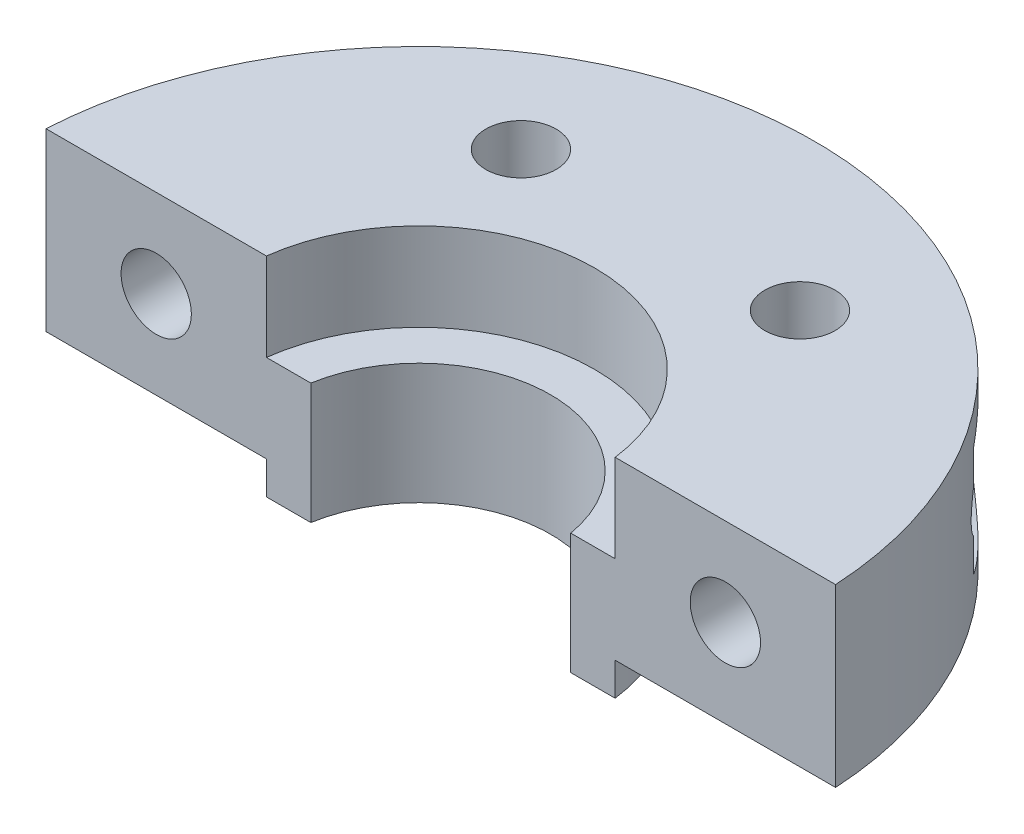
ISO-10303-21;
HEADER;
FILE_DESCRIPTION(('STEP AP214'),'2;1');
FILE_NAME('part.step','',(''),(''),'','','');
FILE_SCHEMA(('AUTOMOTIVE_DESIGN { 1 0 10303 214 1 1 1 1 }'));
ENDSEC;
DATA;
#1=APPLICATION_CONTEXT('core data for automotive mechanical design processes');
#2=APPLICATION_PROTOCOL_DEFINITION('international standard','automotive_design',2000,#1);
#3=PRODUCT_CONTEXT('',#1,'mechanical');
#4=PRODUCT('Part','Part','',(#3));
#5=PRODUCT_RELATED_PRODUCT_CATEGORY('part','',(#4));
#6=PRODUCT_DEFINITION_FORMATION('','',#4);
#7=PRODUCT_DEFINITION_CONTEXT('part definition',#1,'design');
#8=PRODUCT_DEFINITION('design','',#6,#7);
#9=PRODUCT_DEFINITION_SHAPE('','',#8);
#10=(LENGTH_UNIT() NAMED_UNIT(*) SI_UNIT(.MILLI.,.METRE.));
#11=(NAMED_UNIT(*) PLANE_ANGLE_UNIT() SI_UNIT($,.RADIAN.));
#12=(NAMED_UNIT(*) SI_UNIT($,.STERADIAN.) SOLID_ANGLE_UNIT());
#13=UNCERTAINTY_MEASURE_WITH_UNIT(LENGTH_MEASURE(1.E-05),#10,'distance_accuracy_value','');
#14=(GEOMETRIC_REPRESENTATION_CONTEXT(3) GLOBAL_UNCERTAINTY_ASSIGNED_CONTEXT((#13)) GLOBAL_UNIT_ASSIGNED_CONTEXT((#10,
#11,#12)) REPRESENTATION_CONTEXT('',''));
#15=CARTESIAN_POINT('',(0.,0.,0.));
#16=DIRECTION('',(0.,0.,1.));
#17=DIRECTION('',(1.,0.,0.));
#18=AXIS2_PLACEMENT_3D('',#15,#16,#17);
#19=CARTESIAN_POINT('',(0.,8.,0.));
#20=DIRECTION('',(0.,1.,0.));
#21=DIRECTION('',(0.,0.,1.));
#22=AXIS2_PLACEMENT_3D('',#19,#20,#21);
#23=PLANE('',#22);
#24=DIRECTION('',(-1.,0.,0.));
#25=VECTOR('',#24,1.);
#26=CARTESIAN_POINT('',(-20.,8.,-1.));
#27=LINE('',#26,#25);
#28=CARTESIAN_POINT('',(17.9722007556114,8.,-1.));
#29=VERTEX_POINT('',#28);
#30=CARTESIAN_POINT('',(7.93725393319377,8.,-1.));
#31=VERTEX_POINT('',#30);
#32=EDGE_CURVE('E246',#29,#31,#27,.T.);
#33=ORIENTED_EDGE('',*,*,#32,.F.);
#34=CARTESIAN_POINT('',(0.,8.,0.));
#35=DIRECTION('',(0.,1.,0.));
#36=DIRECTION('',(0.,0.,1.));
#37=AXIS2_PLACEMENT_3D('',#34,#35,#36);
#38=CIRCLE('',#37,18.);
#39=CARTESIAN_POINT('',(-17.9722007556114,8.,-1.));
#40=VERTEX_POINT('',#39);
#41=EDGE_CURVE('E297',#29,#40,#38,.T.);
#42=ORIENTED_EDGE('',*,*,#41,.T.);
#43=CARTESIAN_POINT('',(-7.93725393319377,8.,-1.));
#44=VERTEX_POINT('',#43);
#45=EDGE_CURVE('E241',#44,#40,#27,.T.);
#46=ORIENTED_EDGE('',*,*,#45,.F.);
#47=CARTESIAN_POINT('',(0.,8.,0.));
#48=DIRECTION('',(0.,1.,0.));
#49=DIRECTION('',(0.,0.,1.));
#50=AXIS2_PLACEMENT_3D('',#47,#48,#49);
#51=CIRCLE('',#50,8.);
#52=EDGE_CURVE('E291',#31,#44,#51,.T.);
#53=ORIENTED_EDGE('',*,*,#52,.F.);
#54=EDGE_LOOP('',(#33,#42,#46,#53));
#55=FACE_BOUND('',#54,.T.);
#56=CARTESIAN_POINT('',(-6.35085296108588,8.,-11.));
#57=DIRECTION('',(0.,1.,0.));
#58=DIRECTION('',(0.,0.,1.));
#59=AXIS2_PLACEMENT_3D('',#56,#57,#58);
#60=CIRCLE('',#59,1.6);
#61=CARTESIAN_POINT('',(-6.35085296108588,8.,-9.4));
#62=VERTEX_POINT('',#61);
#63=EDGE_CURVE('E288',#62,#62,#60,.T.);
#64=ORIENTED_EDGE('',*,*,#63,.F.);
#65=EDGE_LOOP('',(#64));
#66=FACE_BOUND('',#65,.T.);
#67=CARTESIAN_POINT('',(6.35085296108587,8.,-11.));
#68=DIRECTION('',(0.,1.,0.));
#69=DIRECTION('',(0.,0.,1.));
#70=AXIS2_PLACEMENT_3D('',#67,#68,#69);
#71=CIRCLE('',#70,1.6);
#72=CARTESIAN_POINT('',(6.35085296108587,8.,-9.4));
#73=VERTEX_POINT('',#72);
#74=EDGE_CURVE('E282',#73,#73,#71,.T.);
#75=ORIENTED_EDGE('',*,*,#74,.F.);
#76=EDGE_LOOP('',(#75));
#77=FACE_BOUND('',#76,.T.);
#78=ADVANCED_FACE('F33',(#55,#66,#77),#23,.T.);
#79=CARTESIAN_POINT('',(0.,0.,0.));
#80=DIRECTION('',(0.,1.,0.));
#81=DIRECTION('',(0.,0.,1.));
#82=AXIS2_PLACEMENT_3D('',#79,#80,#81);
#83=PLANE('',#82);
#84=CARTESIAN_POINT('',(-6.35085296108588,0.,-11.));
#85=DIRECTION('',(0.,1.,0.));
#86=DIRECTION('',(0.,0.,1.));
#87=AXIS2_PLACEMENT_3D('',#84,#85,#86);
#88=CIRCLE('',#87,1.6);
#89=CARTESIAN_POINT('',(-6.35085296108588,0.,-9.4));
#90=VERTEX_POINT('',#89);
#91=EDGE_CURVE('E285',#90,#90,#88,.T.);
#92=ORIENTED_EDGE('',*,*,#91,.T.);
#93=EDGE_LOOP('',(#92));
#94=FACE_BOUND('',#93,.T.);
#95=CARTESIAN_POINT('',(0.,0.,0.));
#96=DIRECTION('',(0.,1.,0.));
#97=DIRECTION('',(0.,0.,1.));
#98=AXIS2_PLACEMENT_3D('',#95,#96,#97);
#99=CIRCLE('',#98,18.);
#100=CARTESIAN_POINT('',(17.9722007556114,0.,-1.));
#101=VERTEX_POINT('',#100);
#102=CARTESIAN_POINT('',(-17.9722007556114,0.,-1.));
#103=VERTEX_POINT('',#102);
#104=EDGE_CURVE('E296',#101,#103,#99,.T.);
#105=ORIENTED_EDGE('',*,*,#104,.F.);
#106=DIRECTION('',(-1.,0.,0.));
#107=VECTOR('',#106,1.);
#108=CARTESIAN_POINT('',(0.,0.,-1.));
#109=LINE('',#108,#107);
#110=CARTESIAN_POINT('',(7.93725393319377,0.,-1.));
#111=VERTEX_POINT('',#110);
#112=EDGE_CURVE('E257',#101,#111,#109,.T.);
#113=ORIENTED_EDGE('',*,*,#112,.T.);
#114=CARTESIAN_POINT('',(0.,0.,0.));
#115=DIRECTION('',(0.,1.,0.));
#116=DIRECTION('',(0.,0.,1.));
#117=AXIS2_PLACEMENT_3D('',#114,#115,#116);
#118=CIRCLE('',#117,8.);
#119=CARTESIAN_POINT('',(-7.93725393319377,0.,-1.));
#120=VERTEX_POINT('',#119);
#121=EDGE_CURVE('E278',#111,#120,#118,.T.);
#122=ORIENTED_EDGE('',*,*,#121,.T.);
#123=EDGE_CURVE('E261',#120,#103,#109,.T.);
#124=ORIENTED_EDGE('',*,*,#123,.T.);
#125=EDGE_LOOP('',(#105,#113,#122,#124));
#126=FACE_BOUND('',#125,.T.);
#127=CARTESIAN_POINT('',(6.35085296108587,0.,-11.));
#128=DIRECTION('',(0.,1.,0.));
#129=DIRECTION('',(0.,0.,1.));
#130=AXIS2_PLACEMENT_3D('',#127,#128,#129);
#131=CIRCLE('',#130,1.6);
#132=CARTESIAN_POINT('',(6.35085296108587,0.,-9.4));
#133=VERTEX_POINT('',#132);
#134=EDGE_CURVE('E281',#133,#133,#131,.T.);
#135=ORIENTED_EDGE('',*,*,#134,.T.);
#136=EDGE_LOOP('',(#135));
#137=FACE_BOUND('',#136,.T.);
#138=ADVANCED_FACE('F189',(#94,#126,#137),#83,.F.);
#139=CARTESIAN_POINT('',(0.,8.,0.));
#140=DIRECTION('',(0.,-1.,0.));
#141=DIRECTION('',(0.,0.,-1.));
#142=AXIS2_PLACEMENT_3D('',#139,#140,#141);
#143=CYLINDRICAL_SURFACE('',#142,18.);
#144=CARTESIAN_POINT('',(14.247806848775,1.51646514109989,-11.));
#145=CARTESIAN_POINT('',(14.1961414325629,1.4895698548178,-11.0669209808077));
#146=CARTESIAN_POINT('',(14.1436926788076,1.46430587758673,-11.1338794803748));
#147=CARTESIAN_POINT('',(14.0372720548507,1.41707691486564,-11.2677549841079));
#148=CARTESIAN_POINT('',(13.9833001124335,1.39511208610406,-11.3346719861522));
#149=CARTESIAN_POINT('',(13.8190173165313,1.33416698680836,-11.5353657421448));
#150=CARTESIAN_POINT('',(13.7064861383191,1.30021253474314,-11.6688949528444));
#151=CARTESIAN_POINT('',(13.4749488025381,1.24615861686742,-11.9355452561351));
#152=CARTESIAN_POINT('',(13.3558889461825,1.2262017927032,-12.0686487668311));
#153=CARTESIAN_POINT('',(13.113201498172,1.20183196083508,-12.3319096495808));
#154=CARTESIAN_POINT('',(12.9895774917561,1.19740700441327,-12.4620692097974));
#155=CARTESIAN_POINT('',(12.6911470033375,1.20706324377791,-12.7669797497254));
#156=CARTESIAN_POINT('',(12.5146768451886,1.22878203881853,-12.9399638723686));
#157=CARTESIAN_POINT('',(12.1597003702484,1.30911355911068,-13.2740612122196));
#158=CARTESIAN_POINT('',(11.9812040283973,1.36758919934819,-13.4352160636837));
#159=CARTESIAN_POINT('',(11.6676895740869,1.50877159241259,-13.7075987585252));
#160=CARTESIAN_POINT('',(11.531764349318,1.5832904389516,-13.8219993376751));
#161=CARTESIAN_POINT('',(11.2676382232912,1.75971740256447,-14.038137821751));
#162=CARTESIAN_POINT('',(11.1394308091164,1.86160201800823,-14.1398864829215));
#163=CARTESIAN_POINT('',(10.9193984866691,2.07224443294671,-14.3102239370642));
#164=CARTESIAN_POINT('',(10.82520121582,2.17636578061209,-14.3814765537365));
#165=CARTESIAN_POINT('',(10.6505505160819,2.40277495001579,-14.5112922224872));
#166=CARTESIAN_POINT('',(10.5700927010248,2.52505695077244,-14.5698593258828));
#167=CARTESIAN_POINT('',(10.4629302930282,2.72071620453481,-14.646810623002));
#168=CARTESIAN_POINT('',(10.4293539297601,2.7882782262451,-14.6707199015071));
#169=CARTESIAN_POINT('',(10.3673860990137,2.92695727467304,-14.714575812207));
#170=CARTESIAN_POINT('',(10.3389920501148,2.99807250884941,-14.7345244177341));
#171=CARTESIAN_POINT('',(10.2878905218574,3.14331730298443,-14.7702500325026));
#172=CARTESIAN_POINT('',(10.2651816588962,3.21744612441213,-14.7860280567899));
#173=CARTESIAN_POINT('',(10.2258619180437,3.36805006867123,-14.8132478318579));
#174=CARTESIAN_POINT('',(10.2092501781923,3.44452485819172,-14.8246901955851));
#175=CARTESIAN_POINT('',(10.1723679564749,3.6574431418332,-14.8500439367316));
#176=CARTESIAN_POINT('',(10.1587573466741,3.79569177512691,-14.8593293930284));
#177=CARTESIAN_POINT('',(10.152241873168,4.07279265601587,-14.8637813259487));
#178=CARTESIAN_POINT('',(10.1593284314629,4.21164462973659,-14.8589536517983));
#179=CARTESIAN_POINT('',(10.1926893848485,4.47752909895567,-14.8360859185926));
#180=CARTESIAN_POINT('',(10.2178124706355,4.60477683032999,-14.8188384502138));
#181=CARTESIAN_POINT('',(10.2845975456311,4.852572787856,-14.772565429603));
#182=CARTESIAN_POINT('',(10.3262596787312,4.97312095571034,-14.7435397748995));
#183=CARTESIAN_POINT('',(10.4256041641199,5.20845476363526,-14.6734646471003));
#184=CARTESIAN_POINT('',(10.4837504109743,5.32293867463923,-14.6320647701208));
#185=CARTESIAN_POINT('',(10.6127295317489,5.53980024249445,-14.5387859895771));
#186=CARTESIAN_POINT('',(10.6835664379633,5.64217403429541,-14.486903754707));
#187=CARTESIAN_POINT('',(10.8433262597695,5.84398785330437,-14.3677836872073));
#188=CARTESIAN_POINT('',(10.9333772937584,5.94190720290751,-14.2994910008115));
#189=CARTESIAN_POINT('',(11.1219839741449,6.12084604386191,-14.1532951440329));
#190=CARTESIAN_POINT('',(11.2205448051746,6.20185512837695,-14.0753861022487));
#191=CARTESIAN_POINT('',(11.4703406416383,6.38117690330727,-13.8732681242403));
#192=CARTESIAN_POINT('',(11.6247003958578,6.46993424004397,-13.7444141709016));
#193=CARTESIAN_POINT('',(11.9375058339185,6.61439709193348,-13.4736393649193));
#194=CARTESIAN_POINT('',(12.0959593344014,6.67003361375686,-13.3316919425153));
#195=CARTESIAN_POINT('',(12.3591111794703,6.73808055319031,-13.0871373977939));
#196=CARTESIAN_POINT('',(12.4642007197357,6.75870835035799,-12.9871047828185));
#197=CARTESIAN_POINT('',(12.6727969825521,6.78775991367738,-12.7836411617648));
#198=CARTESIAN_POINT('',(12.776303093187,6.7961790740844,-12.6802088881958));
#199=CARTESIAN_POINT('',(13.0833772031682,6.80454160495183,-12.3657109285006));
#200=CARTESIAN_POINT('',(13.2833960659634,6.78756520822369,-12.1505414528486));
#201=CARTESIAN_POINT('',(13.6128609243128,6.72510257026246,-11.7784859081901));
#202=CARTESIAN_POINT('',(13.7458655894805,6.68938385636533,-11.6229188409724));
#203=CARTESIAN_POINT('',(13.9390763974762,6.62214888525864,-11.3891299245843));
#204=CARTESIAN_POINT('',(14.0022599054126,6.59755018122272,-11.3113489141615));
#205=CARTESIAN_POINT('',(14.1265864117913,6.54387965893083,-11.1556937231298));
#206=CARTESIAN_POINT('',(14.1877293300345,6.51480766511749,-11.0778195389832));
#207=CARTESIAN_POINT('',(14.247806848775,6.48353485890011,-11.));
#208=B_SPLINE_CURVE_WITH_KNOTS('',3,(#144,#145,#146,#147,#148,#149,#150,#151,#152,#153,#154,
#155,#156,#157,#158,#159,#160,#161,#162,#163,#164,#165,#166,#167,#168,#169,#170,#171,#172,#173,
#174,#175,#176,#177,#178,#179,#180,#181,#182,#183,#184,#185,#186,#187,#188,#189,#190,#191,#192,
#193,#194,#195,#196,#197,#198,#199,#200,#201,#202,#203,#204,#205,#206,#207),.UNSPECIFIED.,.F.,
.F.,(4,2,2,2,2,2,2,2,2,2,2,2,2,2,2,2,2,2,2,2,2,2,2,2,2,2,2,2,2,2,2,4),(0.,0.266118569268653,
0.53224977669668,1.06526621232075,1.60363834666363,2.14159621863517,2.88314878150092,
3.62195199359574,4.19782183648991,4.77319869687947,5.24371691373073,5.71408464093311,
5.95122368595345,6.18824428266879,6.42520713952184,6.66213648364427,7.07742812267009,
7.49254766732929,7.88328797514348,8.27403168251544,8.67710123089232,9.08029907732119,
9.52719888704069,9.97437292015629,10.6301391106592,11.2872665780522,11.7263537473317,
12.1656065205019,13.0445425505239,13.6669395845058,13.9763840574645,14.2858406778846),.UNSPECIFIED.);
#209=CARTESIAN_POINT('',(14.247806848775,1.51646514109989,-11.));
#210=VERTEX_POINT('',#209);
#211=CARTESIAN_POINT('',(14.247806848775,6.48353485890011,-11.));
#212=VERTEX_POINT('',#211);
#213=EDGE_CURVE('E134',#210,#212,#208,.T.);
#214=ORIENTED_EDGE('',*,*,#213,.F.);
#215=DIRECTION('',(0.,-1.,0.));
#216=VECTOR('',#215,1.);
#217=CARTESIAN_POINT('',(14.247806848775,8.,-11.));
#218=LINE('',#217,#216);
#219=CARTESIAN_POINT('',(14.247806848775,3.0576914542614,-11.));
#220=VERTEX_POINT('',#219);
#221=EDGE_CURVE('E123',#220,#210,#218,.T.);
#222=ORIENTED_EDGE('',*,*,#221,.F.);
#223=CARTESIAN_POINT('',(14.5547273444026,4.,-10.5905576779554));
#224=CARTESIAN_POINT('',(14.5547279170669,3.93438221925692,-10.590556838972));
#225=CARTESIAN_POINT('',(14.5506453284358,3.86876718735735,-10.5961743740752));
#226=CARTESIAN_POINT('',(14.5348302865256,3.74021987121872,-10.6178565540079));
#227=CARTESIAN_POINT('',(14.5230859976695,3.67729189837989,-10.6339373621035));
#228=CARTESIAN_POINT('',(14.4933375858681,3.55671557860466,-10.6744450912536));
#229=CARTESIAN_POINT('',(14.4754067102037,3.49901501087444,-10.6987742977344));
#230=CARTESIAN_POINT('',(14.434538692223,3.38875502917246,-10.7538492446342));
#231=CARTESIAN_POINT('',(14.4115995717126,3.33619765861265,-10.7845975202945));
#232=CARTESIAN_POINT('',(14.3464563402626,3.20549469994615,-10.8712293123114));
#233=CARTESIAN_POINT('',(14.3010796831742,3.13148770151479,-10.9309422639597));
#234=CARTESIAN_POINT('',(14.2031036079079,2.99571129425263,-11.0579534604653));
#235=CARTESIAN_POINT('',(14.1504823628166,2.93398029986258,-11.1252745132804));
#236=CARTESIAN_POINT('',(14.0523593215688,2.83427194733995,-11.248820183111));
#237=CARTESIAN_POINT('',(14.0079217356541,2.79407567258885,-11.304130893851));
#238=CARTESIAN_POINT('',(13.9163577072722,2.7198669645647,-11.4166661346337));
#239=CARTESIAN_POINT('',(13.8692298436734,2.68585784010201,-11.473891669447));
#240=CARTESIAN_POINT('',(13.7244019735582,2.59258559646846,-11.6474634865748));
#241=CARTESIAN_POINT('',(13.6232496882889,2.54206977556063,-11.7657151138709));
#242=CARTESIAN_POINT('',(13.4102241563007,2.46183302408909,-12.0080379373374));
#243=CARTESIAN_POINT('',(13.2980891677213,2.43297858353218,-12.132159090338));
#244=CARTESIAN_POINT('',(13.0686785493833,2.39986736010395,-12.3789314654156));
#245=CARTESIAN_POINT('',(12.9514058567732,2.39559670327228,-12.5015834775958));
#246=CARTESIAN_POINT('',(12.7279907530179,2.41265484389708,-12.7287346434851));
#247=CARTESIAN_POINT('',(12.6221118975264,2.43110771278645,-12.8337039859278));
#248=CARTESIAN_POINT('',(12.4111807973892,2.49117556511471,-13.0377910837855));
#249=CARTESIAN_POINT('',(12.3061276994609,2.53276216491323,-13.1369158456224));
#250=CARTESIAN_POINT('',(12.1275618215688,2.62769391840441,-13.3016176666699));
#251=CARTESIAN_POINT('',(12.0528897619441,2.67525868423361,-13.369263246727));
#252=CARTESIAN_POINT('',(11.909000583182,2.7856483293644,-13.4975901462705));
#253=CARTESIAN_POINT('',(11.8397755883366,2.848450619671,-13.5582815806984));
#254=CARTESIAN_POINT('',(11.7237172505399,2.97511707681912,-13.6586635636425));
#255=CARTESIAN_POINT('',(11.6752172950308,3.03606078823228,-13.7000992535439));
#256=CARTESIAN_POINT('',(11.5860183855198,3.16757174096335,-13.7756157438783));
#257=CARTESIAN_POINT('',(11.5453174201049,3.23813649289181,-13.8096984409847));
#258=CARTESIAN_POINT('',(11.4738376108445,3.38848506728277,-13.8691473104127));
#259=CARTESIAN_POINT('',(11.4431524899697,3.46834698537165,-13.8944312863664));
#260=CARTESIAN_POINT('',(11.3946611379383,3.6344232485054,-13.9342278376311));
#261=CARTESIAN_POINT('',(11.376840001934,3.72063011389071,-13.9487528792867));
#262=CARTESIAN_POINT('',(11.3572736452994,3.88265532113034,-13.9646862435906));
#263=CARTESIAN_POINT('',(11.3535049823811,3.95807332947205,-13.9677458983141));
#264=CARTESIAN_POINT('',(11.3566428208087,4.10852590415351,-13.965194992695));
#265=CARTESIAN_POINT('',(11.3635453378922,4.18356060311473,-13.9595876683133));
#266=CARTESIAN_POINT('',(11.3867012629044,4.32578103358819,-13.9407041268896));
#267=CARTESIAN_POINT('',(11.4022834885306,4.39315274696403,-13.9279781125011));
#268=CARTESIAN_POINT('',(11.441378940514,4.52386296750746,-13.8958801181362));
#269=CARTESIAN_POINT('',(11.4648928279726,4.58720113795729,-13.8765075841722));
#270=CARTESIAN_POINT('',(11.5204530604143,4.71264757289494,-13.8304207636916));
#271=CARTESIAN_POINT('',(11.5529560856643,4.77440583418504,-13.8033098641981));
#272=CARTESIAN_POINT('',(11.624150069382,4.89120861747914,-13.7434095463967));
#273=CARTESIAN_POINT('',(11.6628447897022,4.9462490218863,-13.7106166749159));
#274=CARTESIAN_POINT('',(11.7633169711265,5.0721936871479,-13.6246260612986));
#275=CARTESIAN_POINT('',(11.827705175878,5.13926220666653,-13.5688408420179));
#276=CARTESIAN_POINT('',(11.9628844161031,5.25873921772288,-13.4498165463979));
#277=CARTESIAN_POINT('',(12.0336881727518,5.31111770033494,-13.3865625818344));
#278=CARTESIAN_POINT('',(12.2030919260813,5.41706258693712,-13.2325941356925));
#279=CARTESIAN_POINT('',(12.303110874281,5.46524105840044,-13.1397387472052));
#280=CARTESIAN_POINT('',(12.5050902599165,5.53929562354019,-12.9476750148998));
#281=CARTESIAN_POINT('',(12.6070527189664,5.56514703517479,-12.8484597701821));
#282=CARTESIAN_POINT('',(12.8382894571198,5.60114577063689,-12.6179115133797));
#283=CARTESIAN_POINT('',(12.9673032745903,5.60495708269032,-12.485296413151));
#284=CARTESIAN_POINT('',(13.1567373850832,5.58846519670768,-12.2844972744102));
#285=CARTESIAN_POINT('',(13.2193006741357,5.57923279790702,-12.2171389468499));
#286=CARTESIAN_POINT('',(13.3427074957586,5.5535254047185,-12.0822380413235));
#287=CARTESIAN_POINT('',(13.403551760622,5.53705354535578,-12.0146955556748));
#288=CARTESIAN_POINT('',(13.5238296018665,5.4967272347379,-11.879155832946));
#289=CARTESIAN_POINT('',(13.5832399455693,5.47279266963154,-11.8111618993566));
#290=CARTESIAN_POINT('',(13.6995866528463,5.41751001328857,-11.676012745507));
#291=CARTESIAN_POINT('',(13.7565221226754,5.38615926976655,-11.6088578343779));
#292=CARTESIAN_POINT('',(13.8672539596244,5.31589591044463,-11.4763537749667));
#293=CARTESIAN_POINT('',(13.9210602919348,5.27700922739635,-11.4109992877227));
#294=CARTESIAN_POINT('',(14.0250995945504,5.19115445111207,-11.2828797907067));
#295=CARTESIAN_POINT('',(14.0753361309491,5.14419458776404,-11.2201122238002));
#296=CARTESIAN_POINT('',(14.1690556379583,5.04397373544411,-11.1014994608789));
#297=CARTESIAN_POINT('',(14.2127494242282,4.99113731059631,-11.045465562499));
#298=CARTESIAN_POINT('',(14.2950116232057,4.87669674937654,-10.938791534288));
#299=CARTESIAN_POINT('',(14.3335852822139,4.81510172363689,-10.8881458941489));
#300=CARTESIAN_POINT('',(14.3972437928419,4.69488080257539,-10.8037783087288));
#301=CARTESIAN_POINT('',(14.4235013333912,4.6378709155961,-10.7686644342861));
#302=CARTESIAN_POINT('',(14.4700837322893,4.51753633899243,-10.7059890459832));
#303=CARTESIAN_POINT('',(14.4904140176938,4.45421749765289,-10.6784206248535));
#304=CARTESIAN_POINT('',(14.5222640961712,4.32682643445046,-10.6350612774925));
#305=CARTESIAN_POINT('',(14.534311028506,4.26313364963762,-10.6185677071177));
#306=CARTESIAN_POINT('',(14.5505354286026,4.13295621469048,-10.596325800098));
#307=CARTESIAN_POINT('',(14.5547267642423,4.0664766967065,-10.5905585279208));
#308=CARTESIAN_POINT('',(14.5547273444026,4.,-10.5905576779554));
#309=B_SPLINE_CURVE_WITH_KNOTS('',3,(#223,#224,#225,#226,#227,#228,#229,#230,#231,#232,#233,
#234,#235,#236,#237,#238,#239,#240,#241,#242,#243,#244,#245,#246,#247,#248,#249,#250,#251,#252,
#253,#254,#255,#256,#257,#258,#259,#260,#261,#262,#263,#264,#265,#266,#267,#268,#269,#270,#271,
#272,#273,#274,#275,#276,#277,#278,#279,#280,#281,#282,#283,#284,#285,#286,#287,#288,#289,#290,
#291,#292,#293,#294,#295,#296,#297,#298,#299,#300,#301,#302,#303,#304,#305,#306,#307,#308),
.UNSPECIFIED.,.T.,.F.,(4,2,2,2,2,2,2,2,2,2,2,2,2,2,2,2,2,2,2,2,2,2,2,2,2,2,2,2,2,2,2,2,2,2,2,2,
2,2,2,2,2,2,4),(0.,0.196513422212143,0.393331133904895,0.587894303812723,0.78253446321999,
1.09686253131808,1.41215924009727,1.65647354296329,1.90091812042238,2.38976250326283,
2.89724922061037,3.4044495076234,3.85355928489643,4.30211924407798,4.63524115936446,
4.96787222069729,5.23153036319623,5.4951204146602,5.76111064887324,6.02679219681324,
6.25229820187505,6.47772003085279,6.68773860766598,6.89777469378507,7.1215175281525,
7.34539682045777,7.66887387720455,7.99300700067595,8.42483870966614,8.85714718969312,
9.40924005262798,9.68620062074221,9.96304136996576,10.2429628077118,10.5229845069334,
10.8020591759326,11.0808510220763,11.3459039611182,11.6106831839252,11.8257207752404,
12.0405608530994,12.2399989847041,12.4390847053612),.UNSPECIFIED.);
#310=CARTESIAN_POINT('',(14.247806848775,4.9423085457386,-11.));
#311=VERTEX_POINT('',#310);
#312=EDGE_CURVE('E132',#311,#220,#309,.T.);
#313=ORIENTED_EDGE('',*,*,#312,.F.);
#314=EDGE_CURVE('E48',#212,#311,#218,.T.);
#315=ORIENTED_EDGE('',*,*,#314,.F.);
#316=EDGE_LOOP('',(#214,#222,#313,#315));
#317=FACE_BOUND('',#316,.T.);
#318=CARTESIAN_POINT('',(-14.247806848775,6.48353485890011,-11.));
#319=CARTESIAN_POINT('',(-14.1961414325629,6.5104301451822,-11.0669209808077));
#320=CARTESIAN_POINT('',(-14.1436926788076,6.53569412241328,-11.1338794803748));
#321=CARTESIAN_POINT('',(-14.0372720548507,6.58292308513436,-11.2677549841079));
#322=CARTESIAN_POINT('',(-13.9833001124335,6.60488791389595,-11.3346719861522));
#323=CARTESIAN_POINT('',(-13.8190173165313,6.66583301319165,-11.5353657421448));
#324=CARTESIAN_POINT('',(-13.7064861383191,6.69978746525686,-11.6688949528444));
#325=CARTESIAN_POINT('',(-13.4749488025381,6.75384138313258,-11.9355452561351));
#326=CARTESIAN_POINT('',(-13.3558889461825,6.7737982072968,-12.0686487668311));
#327=CARTESIAN_POINT('',(-13.1132014981719,6.79816803916492,-12.3319096495808));
#328=CARTESIAN_POINT('',(-12.9895774917561,6.80259299558673,-12.4620692097974));
#329=CARTESIAN_POINT('',(-12.6911470033375,6.79293675622209,-12.7669797497254));
#330=CARTESIAN_POINT('',(-12.5146768451886,6.77121796118147,-12.9399638723686));
#331=CARTESIAN_POINT('',(-12.1597003702484,6.69088644088933,-13.2740612122196));
#332=CARTESIAN_POINT('',(-11.9812040283973,6.63241080065181,-13.4352160636837));
#333=CARTESIAN_POINT('',(-11.6676895740869,6.49122840758742,-13.7075987585252));
#334=CARTESIAN_POINT('',(-11.531764349318,6.4167095610484,-13.8219993376751));
#335=CARTESIAN_POINT('',(-11.2676382232912,6.24028259743553,-14.038137821751));
#336=CARTESIAN_POINT('',(-11.1394308091164,6.13839798199177,-14.1398864829216));
#337=CARTESIAN_POINT('',(-10.9193984866691,5.92775556705329,-14.3102239370642));
#338=CARTESIAN_POINT('',(-10.82520121582,5.8236342193879,-14.3814765537365));
#339=CARTESIAN_POINT('',(-10.6505505160819,5.59722504998421,-14.5112922224872));
#340=CARTESIAN_POINT('',(-10.5700927010248,5.47494304922756,-14.5698593258828));
#341=CARTESIAN_POINT('',(-10.4629302930282,5.27928379546518,-14.646810623002));
#342=CARTESIAN_POINT('',(-10.4293539297601,5.21172177375489,-14.6707199015072));
#343=CARTESIAN_POINT('',(-10.3673860990137,5.07304272532695,-14.714575812207));
#344=CARTESIAN_POINT('',(-10.3389920501148,5.00192749115059,-14.7345244177341));
#345=CARTESIAN_POINT('',(-10.2878905218574,4.85668269701556,-14.7702500325026));
#346=CARTESIAN_POINT('',(-10.2651816588962,4.78255387558786,-14.7860280567899));
#347=CARTESIAN_POINT('',(-10.2258619180437,4.63194993132877,-14.8132478318579));
#348=CARTESIAN_POINT('',(-10.2092501781923,4.55547514180828,-14.8246901955851));
#349=CARTESIAN_POINT('',(-10.1723679564749,4.3425568581668,-14.8500439367316));
#350=CARTESIAN_POINT('',(-10.1587573466741,4.20430822487308,-14.8593293930284));
#351=CARTESIAN_POINT('',(-10.152241873168,3.92720734398412,-14.8637813259487));
#352=CARTESIAN_POINT('',(-10.1593284314629,3.78835537026341,-14.8589536517983));
#353=CARTESIAN_POINT('',(-10.1926893848485,3.52247090104432,-14.8360859185926));
#354=CARTESIAN_POINT('',(-10.2178124706355,3.39522316967,-14.8188384502138));
#355=CARTESIAN_POINT('',(-10.2845975456311,3.147427212144,-14.772565429603));
#356=CARTESIAN_POINT('',(-10.3262596787312,3.02687904428965,-14.7435397748995));
#357=CARTESIAN_POINT('',(-10.4256041641199,2.79154523636474,-14.6734646471003));
#358=CARTESIAN_POINT('',(-10.4837504109743,2.67706132536076,-14.6320647701208));
#359=CARTESIAN_POINT('',(-10.6127295317489,2.46019975750554,-14.5387859895771));
#360=CARTESIAN_POINT('',(-10.6835664379633,2.35782596570458,-14.486903754707));
#361=CARTESIAN_POINT('',(-10.8433262597695,2.15601214669563,-14.3677836872073));
#362=CARTESIAN_POINT('',(-10.9333772937584,2.05809279709248,-14.2994910008115));
#363=CARTESIAN_POINT('',(-11.1219839741449,1.87915395613809,-14.1532951440329));
#364=CARTESIAN_POINT('',(-11.2205448051746,1.79814487162304,-14.0753861022487));
#365=CARTESIAN_POINT('',(-11.4703406416384,1.61882309669272,-13.8732681242403));
#366=CARTESIAN_POINT('',(-11.6247003958578,1.53006575995602,-13.7444141709016));
#367=CARTESIAN_POINT('',(-11.9375058339185,1.38560290806651,-13.4736393649193));
#368=CARTESIAN_POINT('',(-12.0959593344014,1.32996638624314,-13.3316919425153));
#369=CARTESIAN_POINT('',(-12.3591111794703,1.26191944680969,-13.0871373977939));
#370=CARTESIAN_POINT('',(-12.4642007197357,1.24129164964201,-12.9871047828185));
#371=CARTESIAN_POINT('',(-12.6727969825521,1.21224008632262,-12.7836411617648));
#372=CARTESIAN_POINT('',(-12.776303093187,1.2038209259156,-12.6802088881957));
#373=CARTESIAN_POINT('',(-13.0833772031682,1.19545839504817,-12.3657109285006));
#374=CARTESIAN_POINT('',(-13.2833960659635,1.2124347917763,-12.1505414528485));
#375=CARTESIAN_POINT('',(-13.6128609243128,1.27489742973754,-11.7784859081901));
#376=CARTESIAN_POINT('',(-13.7458655894805,1.31061614363467,-11.6229188409723));
#377=CARTESIAN_POINT('',(-13.9390763974762,1.37785111474136,-11.3891299245843));
#378=CARTESIAN_POINT('',(-14.0022599054126,1.40244981877727,-11.3113489141615));
#379=CARTESIAN_POINT('',(-14.1265864117913,1.45612034106917,-11.1556937231298));
#380=CARTESIAN_POINT('',(-14.1877293300345,1.4851923348825,-11.0778195389832));
#381=CARTESIAN_POINT('',(-14.247806848775,1.51646514109989,-11.));
#382=B_SPLINE_CURVE_WITH_KNOTS('',3,(#318,#319,#320,#321,#322,#323,#324,#325,#326,#327,#328,
#329,#330,#331,#332,#333,#334,#335,#336,#337,#338,#339,#340,#341,#342,#343,#344,#345,#346,#347,
#348,#349,#350,#351,#352,#353,#354,#355,#356,#357,#358,#359,#360,#361,#362,#363,#364,#365,#366,
#367,#368,#369,#370,#371,#372,#373,#374,#375,#376,#377,#378,#379,#380,#381),.UNSPECIFIED.,.F.,
.F.,(4,2,2,2,2,2,2,2,2,2,2,2,2,2,2,2,2,2,2,2,2,2,2,2,2,2,2,2,2,2,2,4),(0.,0.266118569268654,
0.532249776696684,1.06526621232075,1.60363834666364,2.14159621863518,2.88314878150092,
3.62195199359575,4.19782183648991,4.77319869687949,5.24371691373074,5.71408464093312,
5.95122368595346,6.18824428266881,6.42520713952185,6.66213648364429,7.0774281226701,
7.4925476673293,7.8832879751435,8.27403168251546,8.67710123089233,9.0802990773212,
9.52719888704071,9.97437292015631,10.6301391106592,11.2872665780522,11.7263537473317,
12.1656065205019,13.044542550524,13.6669395845058,13.9763840574645,14.2858406778846),.UNSPECIFIED.);
#383=CARTESIAN_POINT('',(-14.247806848775,6.48353485890011,-11.));
#384=VERTEX_POINT('',#383);
#385=CARTESIAN_POINT('',(-14.247806848775,1.51646514109989,-11.));
#386=VERTEX_POINT('',#385);
#387=EDGE_CURVE('E163',#384,#386,#382,.T.);
#388=ORIENTED_EDGE('',*,*,#387,.F.);
#389=DIRECTION('',(0.,-1.,0.));
#390=VECTOR('',#389,1.);
#391=CARTESIAN_POINT('',(-14.247806848775,8.,-11.));
#392=LINE('',#391,#390);
#393=CARTESIAN_POINT('',(-14.247806848775,4.94230854573861,-11.));
#394=VERTEX_POINT('',#393);
#395=EDGE_CURVE('E451',#394,#384,#392,.F.);
#396=ORIENTED_EDGE('',*,*,#395,.F.);
#397=CARTESIAN_POINT('',(-11.3547273444026,4.,-13.966752197067));
#398=CARTESIAN_POINT('',(-11.3547313737935,3.92513584218051,-13.9667493999775));
#399=CARTESIAN_POINT('',(-11.3600179206181,3.85023620746989,-13.9624561517387));
#400=CARTESIAN_POINT('',(-11.3808026957119,3.70282069455853,-13.9455190109454));
#401=CARTESIAN_POINT('',(-11.3963091052988,3.63030677506686,-13.9328684280656));
#402=CARTESIAN_POINT('',(-11.436420045017,3.49005691343302,-13.8999625388125));
#403=CARTESIAN_POINT('',(-11.4609846406293,3.4223015303683,-13.8797406060725));
#404=CARTESIAN_POINT('',(-11.5178271001106,3.29265686997204,-13.8326070206296));
#405=CARTESIAN_POINT('',(-11.550106038996,3.23076841189406,-13.8056944355434));
#406=CARTESIAN_POINT('',(-11.6232440004441,3.10978822641846,-13.7441849852506));
#407=CARTESIAN_POINT('',(-11.6645316716095,3.0511582788584,-13.7091953456404));
#408=CARTESIAN_POINT('',(-11.7524672058619,2.94193762828163,-13.6338872089642));
#409=CARTESIAN_POINT('',(-11.7991179541896,2.89135128778586,-13.5935658417545));
#410=CARTESIAN_POINT('',(-11.9218192493213,2.7737752385593,-13.4862833835082));
#411=CARTESIAN_POINT('',(-12.0004590864883,2.71209315707013,-13.4164399888102));
#412=CARTESIAN_POINT('',(-12.1627310230772,2.60638485353131,-13.2695159454954));
#413=CARTESIAN_POINT('',(-12.2463743270439,2.5624001025663,-13.1924188139947));
#414=CARTESIAN_POINT('',(-12.4438469292257,2.47881630284965,-13.0067110684955));
#415=CARTESIAN_POINT('',(-12.5584842881394,2.44551378077762,-12.8961314233614));
#416=CARTESIAN_POINT('',(-12.7869224089432,2.4045894104479,-12.6696730733282));
#417=CARTESIAN_POINT('',(-12.9007224111641,2.39698855673742,-12.5537901146567));
#418=CARTESIAN_POINT('',(-13.1270459898294,2.40519856582078,-12.3169815469968));
#419=CARTESIAN_POINT('',(-13.2394927413077,2.42150377670366,-12.1960011516319));
#420=CARTESIAN_POINT('',(-13.4584533547172,2.4771608153488,-11.9539403445138));
#421=CARTESIAN_POINT('',(-13.564965696603,2.51651851834829,-11.8328599151243));
#422=CARTESIAN_POINT('',(-13.7587094386252,2.61291728567425,-11.6067878822407));
#423=CARTESIAN_POINT('',(-13.8467721917439,2.66753220603905,-11.5014934850848));
#424=CARTESIAN_POINT('',(-13.9724790308673,2.76429662894249,-11.3478736861326));
#425=CARTESIAN_POINT('',(-14.013300620767,2.79900704511755,-11.2974081059389));
#426=CARTESIAN_POINT('',(-14.0924616768371,2.8737128069017,-11.1985054270534));
#427=CARTESIAN_POINT('',(-14.1308024940639,2.9137052391505,-11.1500672293899));
#428=CARTESIAN_POINT('',(-14.2118392611438,3.0078990697961,-11.0466621711285));
#429=CARTESIAN_POINT('',(-14.2538900591879,3.06334531990198,-10.992306695608));
#430=CARTESIAN_POINT('',(-14.3324007948646,3.18321572255056,-10.8897401755235));
#431=CARTESIAN_POINT('',(-14.3688678943187,3.24762816874068,-10.8415212736439));
#432=CARTESIAN_POINT('',(-14.4264034039523,3.3694771240667,-10.7647859451516));
#433=CARTESIAN_POINT('',(-14.4490697122346,3.42490921447409,-10.7343138699396));
#434=CARTESIAN_POINT('',(-14.4887355685555,3.5411213747275,-10.6807141600026));
#435=CARTESIAN_POINT('',(-14.5057440600709,3.60189281039936,-10.6575749367909));
#436=CARTESIAN_POINT('',(-14.5302997560952,3.71651150266619,-10.6240644258764));
#437=CARTESIAN_POINT('',(-14.5389944793321,3.76965575723282,-10.6121505211203));
#438=CARTESIAN_POINT('',(-14.5509667699485,3.87767154632033,-10.5957290188195));
#439=CARTESIAN_POINT('',(-14.554248558859,3.93254170074771,-10.5912156496358));
#440=CARTESIAN_POINT('',(-14.5551088133067,4.04250187875423,-10.590033449062));
#441=CARTESIAN_POINT('',(-14.5526781953155,4.09759211326316,-10.593377111453));
#442=CARTESIAN_POINT('',(-14.5423177068713,4.20626178042997,-10.6075948835051));
#443=CARTESIAN_POINT('',(-14.5343839100837,4.25984010597025,-10.6184743697173));
#444=CARTESIAN_POINT('',(-14.5113457575185,4.37570394060341,-10.6499435505962));
#445=CARTESIAN_POINT('',(-14.495047190785,4.43730907359355,-10.6721438387935));
#446=CARTESIAN_POINT('',(-14.4565920048787,4.55521976196166,-10.7241779919448));
#447=CARTESIAN_POINT('',(-14.4344250017047,4.61151568099603,-10.7540253851475));
#448=CARTESIAN_POINT('',(-14.3740996248039,4.74353157610083,-10.8346117024));
#449=CARTESIAN_POINT('',(-14.3333080157572,4.81604256780853,-10.8885970567306));
#450=CARTESIAN_POINT('',(-14.2447697718818,4.94987103407802,-11.0041750404637));
#451=CARTESIAN_POINT('',(-14.197006746547,5.01116134023631,-11.0657855439713));
#452=CARTESIAN_POINT('',(-14.107210165705,5.11142790322687,-11.1799243119005));
#453=CARTESIAN_POINT('',(-14.0661668955178,5.15236459638862,-11.2315405236938));
#454=CARTESIAN_POINT('',(-13.981435313381,5.22845987909054,-11.3368446721101));
#455=CARTESIAN_POINT('',(-13.937745552884,5.26361526442516,-11.3905337373653));
#456=CARTESIAN_POINT('',(-13.8032888077458,5.36096169633236,-11.5537443770339));
#457=CARTESIAN_POINT('',(-13.7091423399403,5.41502445012283,-11.6653991885999));
#458=CARTESIAN_POINT('',(-13.5098260954087,5.50476936311842,-11.8957512107238));
#459=CARTESIAN_POINT('',(-13.4043511985738,5.53951747982397,-12.0145395582395));
#460=CARTESIAN_POINT('',(-13.1880026267793,5.58676606103068,-12.251624498893));
#461=CARTESIAN_POINT('',(-13.0771304143683,5.59927251841273,-12.3699212159245));
#462=CARTESIAN_POINT('',(-12.8545279596573,5.60065133587554,-12.6010440341621));
#463=CARTESIAN_POINT('',(-12.7428678864592,5.59002797751458,-12.7139331021959));
#464=CARTESIAN_POINT('',(-12.5191913461274,5.54380022194452,-12.9342318146504));
#465=CARTESIAN_POINT('',(-12.4071754078455,5.50822338770261,-13.0416473646877));
#466=CARTESIAN_POINT('',(-12.2165368354212,5.42228842477671,-13.2200042630202));
#467=CARTESIAN_POINT('',(-12.1369658291208,5.3783902516741,-13.2930407877427));
#468=CARTESIAN_POINT('',(-11.9826502851513,5.27424578459047,-13.4323052096008));
#469=CARTESIAN_POINT('',(-11.9078991582352,5.21402242162509,-13.4985424786648));
#470=CARTESIAN_POINT('',(-11.7819648456921,5.0911586147969,-13.6084810293358));
#471=CARTESIAN_POINT('',(-11.7291606393909,5.03179079090314,-13.6539721510061));
#472=CARTESIAN_POINT('',(-11.6310881502908,4.9025176962284,-13.7376100687673));
#473=CARTESIAN_POINT('',(-11.5858126554597,4.83262263366245,-13.7757638990703));
#474=CARTESIAN_POINT('',(-11.5118820486206,4.69518233838978,-13.8375764297887));
#475=CARTESIAN_POINT('',(-11.4817266765852,4.62905092972912,-13.8625776680877));
#476=CARTESIAN_POINT('',(-11.4302226058657,4.49119966264566,-13.9050758180888));
#477=CARTESIAN_POINT('',(-11.4088624018163,4.41948725203016,-13.9225825349185));
#478=CARTESIAN_POINT('',(-11.3801282730971,4.28974985956089,-13.9460724403765));
#479=CARTESIAN_POINT('',(-11.3706412514299,4.23249918226877,-13.9538018086475));
#480=CARTESIAN_POINT('',(-11.3579389642249,4.11683960178564,-13.9641429828687));
#481=CARTESIAN_POINT('',(-11.3547241995097,4.05843060648223,-13.9667543801629));
#482=CARTESIAN_POINT('',(-11.3547273444026,4.,-13.966752197067));
#483=B_SPLINE_CURVE_WITH_KNOTS('',3,(#397,#398,#399,#400,#401,#402,#403,#404,#405,#406,#407,
#408,#409,#410,#411,#412,#413,#414,#415,#416,#417,#418,#419,#420,#421,#422,#423,#424,#425,#426,
#427,#428,#429,#430,#431,#432,#433,#434,#435,#436,#437,#438,#439,#440,#441,#442,#443,#444,#445,
#446,#447,#448,#449,#450,#451,#452,#453,#454,#455,#456,#457,#458,#459,#460,#461,#462,#463,#464,
#465,#466,#467,#468,#469,#470,#471,#472,#473,#474,#475,#476,#477,#478,#479,#480,#481,#482),
.UNSPECIFIED.,.T.,.F.,(4,2,2,2,2,2,2,2,2,2,2,2,2,2,2,2,2,2,2,2,2,2,2,2,2,2,2,2,2,2,2,2,2,2,2,2,
2,2,2,2,2,2,4),(0.,0.224354654324966,0.448889130027787,0.672445317709887,0.896032676789243,
1.1345313495497,1.37315893617364,1.73691335321133,2.10151527883974,2.58708142524537,
3.07304411329935,3.56919870832992,4.06547981007965,4.50708060045885,4.72769183150115,
4.94818188596038,5.2124175206174,5.47631134717863,5.67721923968713,5.87780802509597,
6.04255570764404,6.20717484311717,6.3720559231798,6.53705476155758,6.73838401599181,
6.94007192489553,7.2359632823923,7.53256186401337,7.76510671373325,7.99778001681305,
8.46317268602786,8.94945673400111,9.43560973580894,9.91126983070948,10.386405349438,
10.7350018398367,11.0831111923907,11.3567575556512,11.6301402536559,11.8597751207859,
12.0891086302,12.2642008545075,12.43930705888),.UNSPECIFIED.);
#484=CARTESIAN_POINT('',(-14.247806848775,3.0576914542614,-11.));
#485=VERTEX_POINT('',#484);
#486=EDGE_CURVE('E141',#485,#394,#483,.T.);
#487=ORIENTED_EDGE('',*,*,#486,.F.);
#488=EDGE_CURVE('E56',#386,#485,#392,.F.);
#489=ORIENTED_EDGE('',*,*,#488,.F.);
#490=EDGE_LOOP('',(#388,#396,#487,#489));
#491=FACE_BOUND('',#490,.T.);
#492=ORIENTED_EDGE('',*,*,#41,.F.);
#493=DIRECTION('',(0.,-1.,0.));
#494=VECTOR('',#493,1.);
#495=CARTESIAN_POINT('',(17.9722007556114,8.,-1.));
#496=LINE('',#495,#494);
#497=EDGE_CURVE('E260',#29,#101,#496,.T.);
#498=ORIENTED_EDGE('',*,*,#497,.T.);
#499=ORIENTED_EDGE('',*,*,#104,.T.);
#500=DIRECTION('',(0.,-1.,0.));
#501=VECTOR('',#500,1.);
#502=CARTESIAN_POINT('',(-17.9722007556114,8.,-1.));
#503=LINE('',#502,#501);
#504=EDGE_CURVE('E266',#103,#40,#503,.F.);
#505=ORIENTED_EDGE('',*,*,#504,.T.);
#506=EDGE_LOOP('',(#492,#498,#499,#505));
#507=FACE_BOUND('',#506,.T.);
#508=ADVANCED_FACE('F35',(#317,#491,#507),#143,.T.);
#509=CARTESIAN_POINT('',(0.,8.,0.));
#510=DIRECTION('',(0.,-1.,0.));
#511=DIRECTION('',(0.,0.,-1.));
#512=AXIS2_PLACEMENT_3D('',#509,#510,#511);
#513=CYLINDRICAL_SURFACE('',#512,8.);
#514=DIRECTION('',(0.,-1.,0.));
#515=VECTOR('',#514,1.);
#516=CARTESIAN_POINT('',(7.93725393319377,8.,-1.));
#517=LINE('',#516,#515);
#518=CARTESIAN_POINT('',(7.93725393319377,4.,-1.));
#519=VERTEX_POINT('',#518);
#520=EDGE_CURVE('E250',#31,#519,#517,.T.);
#521=ORIENTED_EDGE('',*,*,#520,.F.);
#522=ORIENTED_EDGE('',*,*,#52,.T.);
#523=DIRECTION('',(0.,-1.,0.));
#524=VECTOR('',#523,1.);
#525=CARTESIAN_POINT('',(-7.93725393319377,8.,-1.));
#526=LINE('',#525,#524);
#527=CARTESIAN_POINT('',(-7.93725393319377,4.,-1.));
#528=VERTEX_POINT('',#527);
#529=EDGE_CURVE('E253',#528,#44,#526,.F.);
#530=ORIENTED_EDGE('',*,*,#529,.F.);
#531=CARTESIAN_POINT('',(0.,4.,0.));
#532=DIRECTION('',(0.,1.,0.));
#533=DIRECTION('',(0.,0.,1.));
#534=AXIS2_PLACEMENT_3D('',#531,#532,#533);
#535=CIRCLE('',#534,8.);
#536=EDGE_CURVE('E300',#519,#528,#535,.T.);
#537=ORIENTED_EDGE('',*,*,#536,.F.);
#538=EDGE_LOOP('',(#521,#522,#530,#537));
#539=FACE_BOUND('',#538,.T.);
#540=ADVANCED_FACE('F199',(#539),#513,.F.);
#541=CARTESIAN_POINT('',(-6.35085296108588,8.,-11.));
#542=DIRECTION('',(0.,-1.,0.));
#543=DIRECTION('',(0.,0.,-1.));
#544=AXIS2_PLACEMENT_3D('',#541,#542,#543);
#545=CYLINDRICAL_SURFACE('',#544,1.6);
#546=ORIENTED_EDGE('',*,*,#63,.T.);
#547=EDGE_LOOP('',(#546));
#548=FACE_BOUND('',#547,.T.);
#549=ORIENTED_EDGE('',*,*,#91,.F.);
#550=EDGE_LOOP('',(#549));
#551=FACE_BOUND('',#550,.T.);
#552=ADVANCED_FACE('F202',(#548,#551),#545,.F.);
#553=CARTESIAN_POINT('',(6.35085296108587,8.,-11.));
#554=DIRECTION('',(0.,-1.,0.));
#555=DIRECTION('',(0.,0.,-1.));
#556=AXIS2_PLACEMENT_3D('',#553,#554,#555);
#557=CYLINDRICAL_SURFACE('',#556,1.6);
#558=ORIENTED_EDGE('',*,*,#74,.T.);
#559=EDGE_LOOP('',(#558));
#560=FACE_BOUND('',#559,.T.);
#561=ORIENTED_EDGE('',*,*,#134,.F.);
#562=EDGE_LOOP('',(#561));
#563=FACE_BOUND('',#562,.T.);
#564=ADVANCED_FACE('F206',(#560,#563),#557,.F.);
#565=CARTESIAN_POINT('',(0.,-1.5,0.));
#566=DIRECTION('',(0.,1.,0.));
#567=DIRECTION('',(0.,0.,1.));
#568=AXIS2_PLACEMENT_3D('',#565,#566,#567);
#569=CYLINDRICAL_SURFACE('',#568,8.);
#570=DIRECTION('',(0.,1.,0.));
#571=VECTOR('',#570,1.);
#572=CARTESIAN_POINT('',(-7.93725393319377,-1.5,-1.));
#573=LINE('',#572,#571);
#574=CARTESIAN_POINT('',(-7.93725393319377,-1.5,-1.));
#575=VERTEX_POINT('',#574);
#576=EDGE_CURVE('E264',#120,#575,#573,.F.);
#577=ORIENTED_EDGE('',*,*,#576,.F.);
#578=ORIENTED_EDGE('',*,*,#121,.F.);
#579=DIRECTION('',(0.,1.,0.));
#580=VECTOR('',#579,1.);
#581=CARTESIAN_POINT('',(7.93725393319377,-1.5,-1.));
#582=LINE('',#581,#580);
#583=CARTESIAN_POINT('',(7.93725393319377,-1.5,-1.));
#584=VERTEX_POINT('',#583);
#585=EDGE_CURVE('E255',#584,#111,#582,.T.);
#586=ORIENTED_EDGE('',*,*,#585,.F.);
#587=CARTESIAN_POINT('',(0.,-1.5,0.));
#588=DIRECTION('',(0.,1.,0.));
#589=DIRECTION('',(0.,0.,1.));
#590=AXIS2_PLACEMENT_3D('',#587,#588,#589);
#591=CIRCLE('',#590,8.);
#592=EDGE_CURVE('E273',#584,#575,#591,.T.);
#593=ORIENTED_EDGE('',*,*,#592,.T.);
#594=EDGE_LOOP('',(#577,#578,#586,#593));
#595=FACE_BOUND('',#594,.T.);
#596=ADVANCED_FACE('F210',(#595),#569,.T.);
#597=CARTESIAN_POINT('',(0.,-1.5,0.));
#598=DIRECTION('',(0.,1.,0.));
#599=DIRECTION('',(0.,0.,1.));
#600=AXIS2_PLACEMENT_3D('',#597,#598,#599);
#601=PLANE('',#600);
#602=ORIENTED_EDGE('',*,*,#592,.F.);
#603=DIRECTION('',(-1.,0.,0.));
#604=VECTOR('',#603,1.);
#605=CARTESIAN_POINT('',(-20.,-1.5,-1.));
#606=LINE('',#605,#604);
#607=CARTESIAN_POINT('',(5.91607978309962,-1.5,-1.));
#608=VERTEX_POINT('',#607);
#609=EDGE_CURVE('E245',#584,#608,#606,.T.);
#610=ORIENTED_EDGE('',*,*,#609,.T.);
#611=CARTESIAN_POINT('',(0.,-1.5,0.));
#612=DIRECTION('',(0.,1.,0.));
#613=DIRECTION('',(0.,0.,1.));
#614=AXIS2_PLACEMENT_3D('',#611,#612,#613);
#615=CIRCLE('',#614,6.);
#616=CARTESIAN_POINT('',(-5.91607978309962,-1.5,-1.));
#617=VERTEX_POINT('',#616);
#618=EDGE_CURVE('E270',#608,#617,#615,.T.);
#619=ORIENTED_EDGE('',*,*,#618,.T.);
#620=EDGE_CURVE('E242',#617,#575,#606,.T.);
#621=ORIENTED_EDGE('',*,*,#620,.T.);
#622=EDGE_LOOP('',(#602,#610,#619,#621));
#623=FACE_BOUND('',#622,.T.);
#624=ADVANCED_FACE('F214',(#623),#601,.F.);
#625=CARTESIAN_POINT('',(0.,4.,0.));
#626=DIRECTION('',(0.,1.,0.));
#627=DIRECTION('',(0.,0.,1.));
#628=AXIS2_PLACEMENT_3D('',#625,#626,#627);
#629=PLANE('',#628);
#630=DIRECTION('',(-1.,0.,0.));
#631=VECTOR('',#630,1.);
#632=CARTESIAN_POINT('',(0.,4.,-1.));
#633=LINE('',#632,#631);
#634=CARTESIAN_POINT('',(5.91607978309962,4.,-1.));
#635=VERTEX_POINT('',#634);
#636=EDGE_CURVE('E248',#519,#635,#633,.T.);
#637=ORIENTED_EDGE('',*,*,#636,.F.);
#638=ORIENTED_EDGE('',*,*,#536,.T.);
#639=CARTESIAN_POINT('',(-5.91607978309962,4.,-1.));
#640=VERTEX_POINT('',#639);
#641=EDGE_CURVE('E251',#640,#528,#633,.T.);
#642=ORIENTED_EDGE('',*,*,#641,.F.);
#643=CARTESIAN_POINT('',(0.,4.,0.));
#644=DIRECTION('',(0.,1.,0.));
#645=DIRECTION('',(0.,0.,1.));
#646=AXIS2_PLACEMENT_3D('',#643,#644,#645);
#647=CIRCLE('',#646,6.);
#648=EDGE_CURVE('E269',#635,#640,#647,.T.);
#649=ORIENTED_EDGE('',*,*,#648,.F.);
#650=EDGE_LOOP('',(#637,#638,#642,#649));
#651=FACE_BOUND('',#650,.T.);
#652=ADVANCED_FACE('F216',(#651),#629,.T.);
#653=CARTESIAN_POINT('',(0.,-1.5,0.));
#654=DIRECTION('',(0.,1.,0.));
#655=DIRECTION('',(0.,0.,1.));
#656=AXIS2_PLACEMENT_3D('',#653,#654,#655);
#657=CYLINDRICAL_SURFACE('',#656,6.);
#658=ORIENTED_EDGE('',*,*,#648,.T.);
#659=DIRECTION('',(0.,1.,0.));
#660=VECTOR('',#659,1.);
#661=CARTESIAN_POINT('',(-5.91607978309962,-1.5,-1.));
#662=LINE('',#661,#660);
#663=EDGE_CURVE('E11',#640,#617,#662,.F.);
#664=ORIENTED_EDGE('',*,*,#663,.T.);
#665=ORIENTED_EDGE('',*,*,#618,.F.);
#666=DIRECTION('',(0.,1.,0.));
#667=VECTOR('',#666,1.);
#668=CARTESIAN_POINT('',(5.91607978309962,-1.5,-1.));
#669=LINE('',#668,#667);
#670=EDGE_CURVE('E41',#608,#635,#669,.T.);
#671=ORIENTED_EDGE('',*,*,#670,.T.);
#672=EDGE_LOOP('',(#658,#664,#665,#671));
#673=FACE_BOUND('',#672,.T.);
#674=ADVANCED_FACE('F219',(#673),#657,.F.);
#675=CARTESIAN_POINT('',(-20.,-1.5,-1.));
#676=DIRECTION('',(0.,0.,-1.));
#677=DIRECTION('',(-1.,0.,0.));
#678=AXIS2_PLACEMENT_3D('',#675,#676,#677);
#679=PLANE('',#678);
#680=CARTESIAN_POINT('',(12.9547273444026,4.,-1.));
#681=DIRECTION('',(0.,0.,1.));
#682=DIRECTION('',(1.,0.,0.));
#683=AXIS2_PLACEMENT_3D('',#680,#681,#682);
#684=CIRCLE('',#683,1.6);
#685=CARTESIAN_POINT('',(14.5547273444026,4.,-1.));
#686=VERTEX_POINT('',#685);
#687=EDGE_CURVE('E138',#686,#686,#684,.T.);
#688=ORIENTED_EDGE('',*,*,#687,.F.);
#689=EDGE_LOOP('',(#688));
#690=FACE_BOUND('',#689,.T.);
#691=ORIENTED_EDGE('',*,*,#32,.T.);
#692=ORIENTED_EDGE('',*,*,#520,.T.);
#693=ORIENTED_EDGE('',*,*,#636,.T.);
#694=ORIENTED_EDGE('',*,*,#670,.F.);
#695=ORIENTED_EDGE('',*,*,#609,.F.);
#696=ORIENTED_EDGE('',*,*,#585,.T.);
#697=ORIENTED_EDGE('',*,*,#112,.F.);
#698=ORIENTED_EDGE('',*,*,#497,.F.);
#699=EDGE_LOOP('',(#691,#692,#693,#694,#695,#696,#697,#698));
#700=FACE_BOUND('',#699,.T.);
#701=ADVANCED_FACE('F226',(#690,#700),#679,.F.);
#702=CARTESIAN_POINT('',(-12.9547273444026,4.,-1.));
#703=DIRECTION('',(0.,0.,1.));
#704=DIRECTION('',(1.,0.,0.));
#705=AXIS2_PLACEMENT_3D('',#702,#703,#704);
#706=CIRCLE('',#705,1.6);
#707=CARTESIAN_POINT('',(-11.3547273444026,4.,-1.));
#708=VERTEX_POINT('',#707);
#709=EDGE_CURVE('E137',#708,#708,#706,.T.);
#710=ORIENTED_EDGE('',*,*,#709,.F.);
#711=EDGE_LOOP('',(#710));
#712=FACE_BOUND('',#711,.T.);
#713=ORIENTED_EDGE('',*,*,#123,.F.);
#714=ORIENTED_EDGE('',*,*,#576,.T.);
#715=ORIENTED_EDGE('',*,*,#620,.F.);
#716=ORIENTED_EDGE('',*,*,#663,.F.);
#717=ORIENTED_EDGE('',*,*,#641,.T.);
#718=ORIENTED_EDGE('',*,*,#529,.T.);
#719=ORIENTED_EDGE('',*,*,#45,.T.);
#720=ORIENTED_EDGE('',*,*,#504,.F.);
#721=EDGE_LOOP('',(#713,#714,#715,#716,#717,#718,#719,#720));
#722=FACE_BOUND('',#721,.T.);
#723=ADVANCED_FACE('F228',(#712,#722),#679,.F.);
#724=CARTESIAN_POINT('',(-12.9547273444026,4.,-18.001));
#725=DIRECTION('',(0.,0.,1.));
#726=DIRECTION('',(1.,0.,0.));
#727=AXIS2_PLACEMENT_3D('',#724,#725,#726);
#728=CYLINDRICAL_SURFACE('',#727,1.6);
#729=ORIENTED_EDGE('',*,*,#709,.T.);
#730=EDGE_LOOP('',(#729));
#731=FACE_BOUND('',#730,.T.);
#732=ORIENTED_EDGE('',*,*,#486,.T.);
#733=CARTESIAN_POINT('',(-12.9547273444026,4.,-11.));
#734=DIRECTION('',(0.,0.,1.));
#735=DIRECTION('',(1.,0.,0.));
#736=AXIS2_PLACEMENT_3D('',#733,#734,#735);
#737=CIRCLE('',#736,1.6);
#738=EDGE_CURVE('E447',#485,#394,#737,.T.);
#739=ORIENTED_EDGE('',*,*,#738,.F.);
#740=EDGE_LOOP('',(#732,#739));
#741=FACE_BOUND('',#740,.T.);
#742=ADVANCED_FACE('F231',(#731,#741),#728,.F.);
#743=CARTESIAN_POINT('',(12.9547273444026,4.,-18.001));
#744=DIRECTION('',(0.,0.,1.));
#745=DIRECTION('',(1.,0.,0.));
#746=AXIS2_PLACEMENT_3D('',#743,#744,#745);
#747=CYLINDRICAL_SURFACE('',#746,1.6);
#748=ORIENTED_EDGE('',*,*,#687,.T.);
#749=EDGE_LOOP('',(#748));
#750=FACE_BOUND('',#749,.T.);
#751=ORIENTED_EDGE('',*,*,#312,.T.);
#752=CARTESIAN_POINT('',(12.9547273444026,4.,-11.));
#753=DIRECTION('',(0.,0.,1.));
#754=DIRECTION('',(1.,0.,0.));
#755=AXIS2_PLACEMENT_3D('',#752,#753,#754);
#756=CIRCLE('',#755,1.6);
#757=EDGE_CURVE('E120',#311,#220,#756,.T.);
#758=ORIENTED_EDGE('',*,*,#757,.F.);
#759=EDGE_LOOP('',(#751,#758));
#760=FACE_BOUND('',#759,.T.);
#761=ADVANCED_FACE('F136',(#750,#760),#747,.F.);
#762=CARTESIAN_POINT('',(-12.9547273444026,4.,-18.001));
#763=DIRECTION('',(0.,0.,1.));
#764=DIRECTION('',(1.,0.,0.));
#765=AXIS2_PLACEMENT_3D('',#762,#763,#764);
#766=CYLINDRICAL_SURFACE('',#765,2.8);
#767=ORIENTED_EDGE('',*,*,#387,.T.);
#768=CARTESIAN_POINT('',(-12.9547273444026,4.,-11.));
#769=DIRECTION('',(0.,0.,1.));
#770=DIRECTION('',(1.,0.,0.));
#771=AXIS2_PLACEMENT_3D('',#768,#769,#770);
#772=CIRCLE('',#771,2.8);
#773=EDGE_CURVE('E169',#386,#384,#772,.T.);
#774=ORIENTED_EDGE('',*,*,#773,.T.);
#775=EDGE_LOOP('',(#767,#774));
#776=FACE_BOUND('',#775,.T.);
#777=ADVANCED_FACE('F155',(#776),#766,.F.);
#778=CARTESIAN_POINT('',(-12.9547273444026,4.,-11.));
#779=DIRECTION('',(0.,0.,1.));
#780=DIRECTION('',(1.,0.,0.));
#781=AXIS2_PLACEMENT_3D('',#778,#779,#780);
#782=PLANE('',#781);
#783=ORIENTED_EDGE('',*,*,#488,.T.);
#784=ORIENTED_EDGE('',*,*,#738,.T.);
#785=ORIENTED_EDGE('',*,*,#395,.T.);
#786=ORIENTED_EDGE('',*,*,#773,.F.);
#787=EDGE_LOOP('',(#783,#784,#785,#786));
#788=FACE_BOUND('',#787,.T.);
#789=ADVANCED_FACE('F159',(#788),#782,.F.);
#790=CARTESIAN_POINT('',(12.9547273444026,4.,-18.001));
#791=DIRECTION('',(0.,0.,1.));
#792=DIRECTION('',(1.,0.,0.));
#793=AXIS2_PLACEMENT_3D('',#790,#791,#792);
#794=CYLINDRICAL_SURFACE('',#793,2.8);
#795=ORIENTED_EDGE('',*,*,#213,.T.);
#796=CARTESIAN_POINT('',(12.9547273444026,4.,-11.));
#797=DIRECTION('',(0.,0.,1.));
#798=DIRECTION('',(1.,0.,0.));
#799=AXIS2_PLACEMENT_3D('',#796,#797,#798);
#800=CIRCLE('',#799,2.8);
#801=EDGE_CURVE('E128',#212,#210,#800,.T.);
#802=ORIENTED_EDGE('',*,*,#801,.T.);
#803=EDGE_LOOP('',(#795,#802));
#804=FACE_BOUND('',#803,.T.);
#805=ADVANCED_FACE('F173',(#804),#794,.F.);
#806=CARTESIAN_POINT('',(12.9547273444026,4.,-11.));
#807=DIRECTION('',(0.,0.,1.));
#808=DIRECTION('',(1.,0.,0.));
#809=AXIS2_PLACEMENT_3D('',#806,#807,#808);
#810=PLANE('',#809);
#811=ORIENTED_EDGE('',*,*,#314,.T.);
#812=ORIENTED_EDGE('',*,*,#757,.T.);
#813=ORIENTED_EDGE('',*,*,#221,.T.);
#814=ORIENTED_EDGE('',*,*,#801,.F.);
#815=EDGE_LOOP('',(#811,#812,#813,#814));
#816=FACE_BOUND('',#815,.T.);
#817=ADVANCED_FACE('F122',(#816),#810,.F.);
#818=CLOSED_SHELL('',(#78,#138,#508,#540,#552,#564,#596,#624,#652,#674,#701,#723,#742,#761,#777,
#789,#805,#817));
#819=MANIFOLD_SOLID_BREP('B2',#818);
#820=ADVANCED_BREP_SHAPE_REPRESENTATION('',(#18,#819),#14);
#821=SHAPE_DEFINITION_REPRESENTATION(#9,#820);
ENDSEC;
END-ISO-10303-21;
